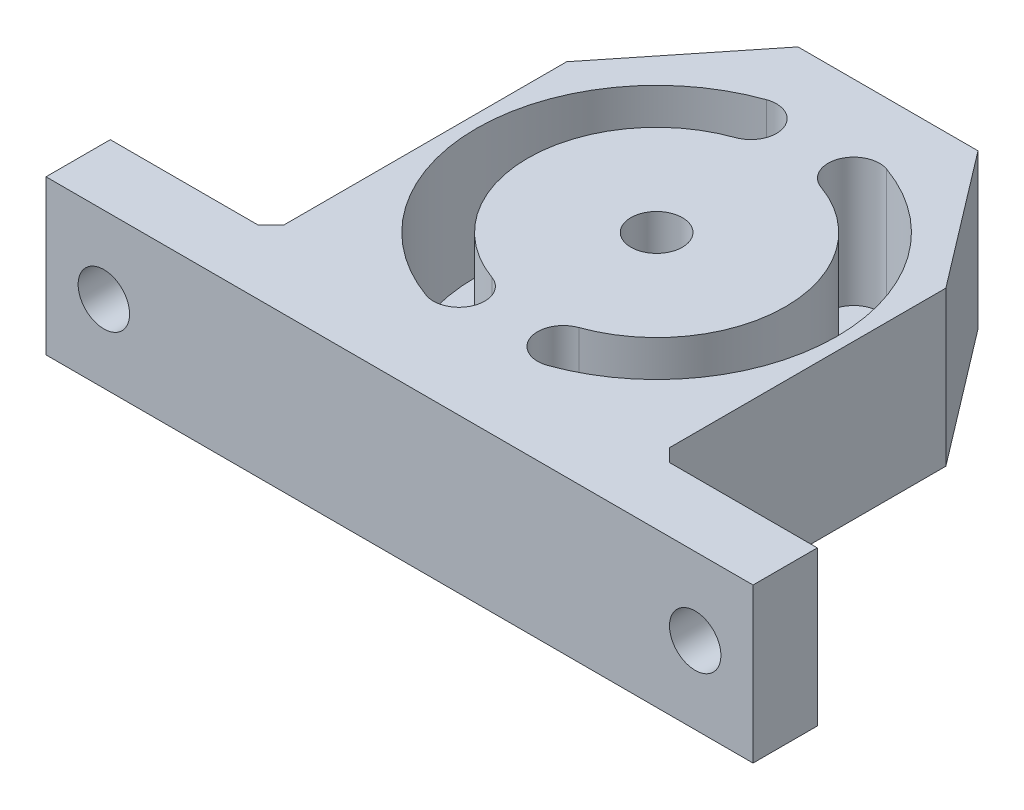
ISO-10303-21;
HEADER;
FILE_DESCRIPTION(('STEP AP214'),'2;1');
FILE_NAME('part.step','',(''),(''),'','','');
FILE_SCHEMA(('AUTOMOTIVE_DESIGN { 1 0 10303 214 1 1 1 1 }'));
ENDSEC;
DATA;
#1=APPLICATION_CONTEXT('core data for automotive mechanical design processes');
#2=APPLICATION_PROTOCOL_DEFINITION('international standard','automotive_design',2000,#1);
#3=PRODUCT_CONTEXT('',#1,'mechanical');
#4=PRODUCT('Part','Part','',(#3));
#5=PRODUCT_RELATED_PRODUCT_CATEGORY('part','',(#4));
#6=PRODUCT_DEFINITION_FORMATION('','',#4);
#7=PRODUCT_DEFINITION_CONTEXT('part definition',#1,'design');
#8=PRODUCT_DEFINITION('design','',#6,#7);
#9=PRODUCT_DEFINITION_SHAPE('','',#8);
#10=(LENGTH_UNIT() NAMED_UNIT(*) SI_UNIT(.MILLI.,.METRE.));
#11=(NAMED_UNIT(*) PLANE_ANGLE_UNIT() SI_UNIT($,.RADIAN.));
#12=(NAMED_UNIT(*) SI_UNIT($,.STERADIAN.) SOLID_ANGLE_UNIT());
#13=UNCERTAINTY_MEASURE_WITH_UNIT(LENGTH_MEASURE(1.E-05),#10,'distance_accuracy_value','');
#14=(GEOMETRIC_REPRESENTATION_CONTEXT(3) GLOBAL_UNCERTAINTY_ASSIGNED_CONTEXT((#13)) GLOBAL_UNIT_ASSIGNED_CONTEXT((#10,
#11,#12)) REPRESENTATION_CONTEXT('',''));
#15=CARTESIAN_POINT('',(0.,0.,0.));
#16=DIRECTION('',(0.,0.,1.));
#17=DIRECTION('',(1.,0.,0.));
#18=AXIS2_PLACEMENT_3D('',#15,#16,#17);
#19=CARTESIAN_POINT('',(0.,12.,0.));
#20=DIRECTION('',(0.,1.,0.));
#21=DIRECTION('',(0.,0.,1.));
#22=AXIS2_PLACEMENT_3D('',#19,#20,#21);
#23=PLANE('',#22);
#24=CARTESIAN_POINT('',(0.,12.,1.49999999999999));
#25=DIRECTION('',(0.,1.,0.));
#26=DIRECTION('',(0.,0.,1.));
#27=AXIS2_PLACEMENT_3D('',#24,#25,#26);
#28=CIRCLE('',#27,2.);
#29=CARTESIAN_POINT('',(0.,12.,3.49999999999999));
#30=VERTEX_POINT('',#29);
#31=EDGE_CURVE('E207',#30,#30,#28,.T.);
#32=ORIENTED_EDGE('',*,*,#31,.F.);
#33=EDGE_LOOP('',(#32));
#34=FACE_BOUND('',#33,.T.);
#35=DIRECTION('',(0.,0.,-1.));
#36=VECTOR('',#35,1.);
#37=CARTESIAN_POINT('',(27.5,12.,16.5));
#38=LINE('',#37,#36);
#39=CARTESIAN_POINT('',(27.5,12.,21.5));
#40=VERTEX_POINT('',#39);
#41=CARTESIAN_POINT('',(27.5,12.,16.5));
#42=VERTEX_POINT('',#41);
#43=EDGE_CURVE('E266',#40,#42,#38,.T.);
#44=ORIENTED_EDGE('',*,*,#43,.T.);
#45=DIRECTION('',(-1.,0.,0.));
#46=VECTOR('',#45,1.);
#47=CARTESIAN_POINT('',(15.,12.,16.5));
#48=LINE('',#47,#46);
#49=CARTESIAN_POINT('',(16.,12.,16.5));
#50=VERTEX_POINT('',#49);
#51=EDGE_CURVE('E269',#42,#50,#48,.T.);
#52=ORIENTED_EDGE('',*,*,#51,.T.);
#53=DIRECTION('',(0.707106781186545,0.,0.70710678118655));
#54=VECTOR('',#53,1.);
#55=CARTESIAN_POINT('',(15.,12.,15.5));
#56=LINE('',#55,#54);
#57=CARTESIAN_POINT('',(15.,12.,15.5));
#58=VERTEX_POINT('',#57);
#59=EDGE_CURVE('E11',#50,#58,#56,.F.);
#60=ORIENTED_EDGE('',*,*,#59,.T.);
#61=DIRECTION('',(0.,0.,-1.));
#62=VECTOR('',#61,1.);
#63=CARTESIAN_POINT('',(15.,12.,16.5));
#64=LINE('',#63,#62);
#65=CARTESIAN_POINT('',(15.,12.,-6.00000000000001));
#66=VERTEX_POINT('',#65);
#67=EDGE_CURVE('E272',#58,#66,#64,.T.);
#68=ORIENTED_EDGE('',*,*,#67,.T.);
#69=DIRECTION('',(-0.606043215262856,0.,-0.795431720032499));
#70=VECTOR('',#69,1.);
#71=CARTESIAN_POINT('',(7.,12.,-16.5));
#72=LINE('',#71,#70);
#73=CARTESIAN_POINT('',(7.,12.,-16.5));
#74=VERTEX_POINT('',#73);
#75=EDGE_CURVE('E274',#66,#74,#72,.T.);
#76=ORIENTED_EDGE('',*,*,#75,.T.);
#77=DIRECTION('',(-1.,0.,0.));
#78=VECTOR('',#77,1.);
#79=CARTESIAN_POINT('',(-7.,12.,-16.5));
#80=LINE('',#79,#78);
#81=CARTESIAN_POINT('',(-7.,12.,-16.5));
#82=VERTEX_POINT('',#81);
#83=EDGE_CURVE('E276',#74,#82,#80,.T.);
#84=ORIENTED_EDGE('',*,*,#83,.T.);
#85=DIRECTION('',(-0.624695047554424,0.,0.78086880944303));
#86=VECTOR('',#85,1.);
#87=CARTESIAN_POINT('',(-15.,12.,-6.50000000000001));
#88=LINE('',#87,#86);
#89=CARTESIAN_POINT('',(-15.,12.,-6.50000000000001));
#90=VERTEX_POINT('',#89);
#91=EDGE_CURVE('E278',#82,#90,#88,.T.);
#92=ORIENTED_EDGE('',*,*,#91,.T.);
#93=DIRECTION('',(0.,0.,1.));
#94=VECTOR('',#93,1.);
#95=CARTESIAN_POINT('',(-15.,12.,16.5));
#96=LINE('',#95,#94);
#97=CARTESIAN_POINT('',(-15.,12.,15.5));
#98=VERTEX_POINT('',#97);
#99=EDGE_CURVE('E280',#90,#98,#96,.T.);
#100=ORIENTED_EDGE('',*,*,#99,.T.);
#101=DIRECTION('',(0.707106781186552,0.,-0.707106781186543));
#102=VECTOR('',#101,1.);
#103=CARTESIAN_POINT('',(-16.,12.,16.5));
#104=LINE('',#103,#102);
#105=CARTESIAN_POINT('',(-16.,12.,16.5));
#106=VERTEX_POINT('',#105);
#107=EDGE_CURVE('E344',#98,#106,#104,.F.);
#108=ORIENTED_EDGE('',*,*,#107,.T.);
#109=DIRECTION('',(-1.,0.,0.));
#110=VECTOR('',#109,1.);
#111=CARTESIAN_POINT('',(-27.5,12.,16.5));
#112=LINE('',#111,#110);
#113=CARTESIAN_POINT('',(-27.5,12.,16.5));
#114=VERTEX_POINT('',#113);
#115=EDGE_CURVE('E283',#106,#114,#112,.T.);
#116=ORIENTED_EDGE('',*,*,#115,.T.);
#117=DIRECTION('',(0.,0.,1.));
#118=VECTOR('',#117,1.);
#119=CARTESIAN_POINT('',(-27.5,12.,16.5));
#120=LINE('',#119,#118);
#121=CARTESIAN_POINT('',(-27.5,12.,21.5));
#122=VERTEX_POINT('',#121);
#123=EDGE_CURVE('E285',#114,#122,#120,.T.);
#124=ORIENTED_EDGE('',*,*,#123,.T.);
#125=DIRECTION('',(1.,0.,0.));
#126=VECTOR('',#125,1.);
#127=CARTESIAN_POINT('',(-27.5,12.,21.5));
#128=LINE('',#127,#126);
#129=EDGE_CURVE('E287',#122,#40,#128,.T.);
#130=ORIENTED_EDGE('',*,*,#129,.T.);
#131=EDGE_LOOP('',(#44,#52,#60,#68,#76,#84,#92,#100,#108,#116,#124,#130));
#132=FACE_BOUND('',#131,.T.);
#133=CARTESIAN_POINT('',(0.,12.,1.49999999999999));
#134=DIRECTION('',(0.,1.,0.));
#135=DIRECTION('',(0.,0.,1.));
#136=AXIS2_PLACEMENT_3D('',#133,#134,#135);
#137=CIRCLE('',#136,14.0184169794819);
#138=CARTESIAN_POINT('',(4.6728056598273,12.,-11.7166902769231));
#139=VERTEX_POINT('',#138);
#140=CARTESIAN_POINT('',(4.72970013097378,12.,14.6964370676972));
#141=VERTEX_POINT('',#140);
#142=EDGE_CURVE('E238',#139,#141,#137,.F.);
#143=ORIENTED_EDGE('',*,*,#142,.T.);
#144=CARTESIAN_POINT('',(4.05491636075259,12.,12.8137084989848));
#145=DIRECTION('',(0.,1.,0.));
#146=DIRECTION('',(0.,0.,1.));
#147=AXIS2_PLACEMENT_3D('',#144,#145,#146);
#148=CIRCLE('',#147,2.);
#149=CARTESIAN_POINT('',(3.3801325905314,12.,10.9309799302723));
#150=VERTEX_POINT('',#149);
#151=EDGE_CURVE('E235',#141,#150,#148,.F.);
#152=ORIENTED_EDGE('',*,*,#151,.T.);
#153=CARTESIAN_POINT('',(0.,12.,1.49999999999999));
#154=DIRECTION('',(0.,1.,0.));
#155=DIRECTION('',(0.,0.,1.));
#156=AXIS2_PLACEMENT_3D('',#153,#154,#155);
#157=CIRCLE('',#156,10.0184169794819);
#158=CARTESIAN_POINT('',(3.33947232649396,12.,-7.94545411059482));
#159=VERTEX_POINT('',#158);
#160=EDGE_CURVE('E227',#159,#150,#157,.F.);
#161=ORIENTED_EDGE('',*,*,#160,.F.);
#162=CARTESIAN_POINT('',(4.00613899316063,12.,-9.83107219375894));
#163=DIRECTION('',(0.,1.,0.));
#164=DIRECTION('',(0.,0.,1.));
#165=AXIS2_PLACEMENT_3D('',#162,#163,#164);
#166=CIRCLE('',#165,2.);
#167=EDGE_CURVE('E242',#159,#139,#166,.F.);
#168=ORIENTED_EDGE('',*,*,#167,.T.);
#169=EDGE_LOOP('',(#143,#152,#161,#168));
#170=FACE_BOUND('',#169,.T.);
#171=CARTESIAN_POINT('',(0.,12.,1.49999999999999));
#172=DIRECTION('',(0.,1.,0.));
#173=DIRECTION('',(0.,0.,1.));
#174=AXIS2_PLACEMENT_3D('',#171,#172,#173);
#175=CIRCLE('',#174,14.0184169794819);
#176=CARTESIAN_POINT('',(-4.6728056598273,12.,-11.7166902769231));
#177=VERTEX_POINT('',#176);
#178=CARTESIAN_POINT('',(-4.72970013097379,12.,14.6964370676972));
#179=VERTEX_POINT('',#178);
#180=EDGE_CURVE('E184',#177,#179,#175,.T.);
#181=ORIENTED_EDGE('',*,*,#180,.F.);
#182=CARTESIAN_POINT('',(-4.00613899316063,12.,-9.83107219375894));
#183=DIRECTION('',(0.,1.,0.));
#184=DIRECTION('',(0.,0.,1.));
#185=AXIS2_PLACEMENT_3D('',#182,#183,#184);
#186=CIRCLE('',#185,2.);
#187=CARTESIAN_POINT('',(-3.33947232649396,12.,-7.94545411059482));
#188=VERTEX_POINT('',#187);
#189=EDGE_CURVE('E201',#188,#177,#186,.T.);
#190=ORIENTED_EDGE('',*,*,#189,.F.);
#191=CARTESIAN_POINT('',(0.,12.,1.49999999999999));
#192=DIRECTION('',(0.,1.,0.));
#193=DIRECTION('',(0.,0.,1.));
#194=AXIS2_PLACEMENT_3D('',#191,#192,#193);
#195=CIRCLE('',#194,10.0184169794819);
#196=CARTESIAN_POINT('',(-3.3801325905314,12.,10.9309799302723));
#197=VERTEX_POINT('',#196);
#198=EDGE_CURVE('E204',#188,#197,#195,.T.);
#199=ORIENTED_EDGE('',*,*,#198,.T.);
#200=CARTESIAN_POINT('',(-4.05491636075259,12.,12.8137084989848));
#201=DIRECTION('',(0.,1.,0.));
#202=DIRECTION('',(0.,0.,1.));
#203=AXIS2_PLACEMENT_3D('',#200,#201,#202);
#204=CIRCLE('',#203,2.);
#205=EDGE_CURVE('E213',#179,#197,#204,.T.);
#206=ORIENTED_EDGE('',*,*,#205,.F.);
#207=EDGE_LOOP('',(#181,#190,#199,#206));
#208=FACE_BOUND('',#207,.T.);
#209=ADVANCED_FACE('F41',(#34,#132,#170,#208),#23,.T.);
#210=CARTESIAN_POINT('',(27.5,12.,16.5));
#211=DIRECTION('',(-1.,0.,0.));
#212=DIRECTION('',(0.,0.,1.));
#213=AXIS2_PLACEMENT_3D('',#210,#211,#212);
#214=PLANE('',#213);
#215=DIRECTION('',(0.,0.,-1.));
#216=VECTOR('',#215,1.);
#217=CARTESIAN_POINT('',(27.5,0.,16.5));
#218=LINE('',#217,#216);
#219=CARTESIAN_POINT('',(27.5,0.,21.5));
#220=VERTEX_POINT('',#219);
#221=CARTESIAN_POINT('',(27.5,0.,16.5));
#222=VERTEX_POINT('',#221);
#223=EDGE_CURVE('E265',#220,#222,#218,.T.);
#224=ORIENTED_EDGE('',*,*,#223,.T.);
#225=DIRECTION('',(0.,-1.,0.));
#226=VECTOR('',#225,1.);
#227=CARTESIAN_POINT('',(27.5,12.,16.5));
#228=LINE('',#227,#226);
#229=EDGE_CURVE('E330',#42,#222,#228,.T.);
#230=ORIENTED_EDGE('',*,*,#229,.F.);
#231=ORIENTED_EDGE('',*,*,#43,.F.);
#232=DIRECTION('',(0.,-1.,0.));
#233=VECTOR('',#232,1.);
#234=CARTESIAN_POINT('',(27.5,12.,21.5));
#235=LINE('',#234,#233);
#236=EDGE_CURVE('E289',#40,#220,#235,.T.);
#237=ORIENTED_EDGE('',*,*,#236,.T.);
#238=EDGE_LOOP('',(#224,#230,#231,#237));
#239=FACE_BOUND('',#238,.T.);
#240=ADVANCED_FACE('F391',(#239),#214,.F.);
#241=CARTESIAN_POINT('',(15.,12.,16.5));
#242=DIRECTION('',(0.,0.,1.));
#243=DIRECTION('',(1.,0.,0.));
#244=AXIS2_PLACEMENT_3D('',#241,#242,#243);
#245=PLANE('',#244);
#246=CARTESIAN_POINT('',(23.,6.,16.5));
#247=DIRECTION('',(0.,0.,1.));
#248=DIRECTION('',(1.,0.,0.));
#249=AXIS2_PLACEMENT_3D('',#246,#247,#248);
#250=CIRCLE('',#249,2.);
#251=CARTESIAN_POINT('',(25.,6.,16.5));
#252=VERTEX_POINT('',#251);
#253=EDGE_CURVE('E257',#252,#252,#250,.T.);
#254=ORIENTED_EDGE('',*,*,#253,.T.);
#255=EDGE_LOOP('',(#254));
#256=FACE_BOUND('',#255,.T.);
#257=DIRECTION('',(-1.,0.,0.));
#258=VECTOR('',#257,1.);
#259=CARTESIAN_POINT('',(15.,0.,16.5));
#260=LINE('',#259,#258);
#261=CARTESIAN_POINT('',(16.,0.,16.5));
#262=VERTEX_POINT('',#261);
#263=EDGE_CURVE('E292',#222,#262,#260,.T.);
#264=ORIENTED_EDGE('',*,*,#263,.T.);
#265=DIRECTION('',(0.,1.,0.));
#266=VECTOR('',#265,1.);
#267=CARTESIAN_POINT('',(16.,12.,16.5));
#268=LINE('',#267,#266);
#269=EDGE_CURVE('E57',#262,#50,#268,.T.);
#270=ORIENTED_EDGE('',*,*,#269,.T.);
#271=ORIENTED_EDGE('',*,*,#51,.F.);
#272=ORIENTED_EDGE('',*,*,#229,.T.);
#273=EDGE_LOOP('',(#264,#270,#271,#272));
#274=FACE_BOUND('',#273,.T.);
#275=ADVANCED_FACE('F389',(#256,#274),#245,.F.);
#276=CARTESIAN_POINT('',(15.,12.,16.5));
#277=DIRECTION('',(-1.,0.,0.));
#278=DIRECTION('',(0.,0.,1.));
#279=AXIS2_PLACEMENT_3D('',#276,#277,#278);
#280=PLANE('',#279);
#281=ORIENTED_EDGE('',*,*,#67,.F.);
#282=DIRECTION('',(0.,-1.,0.));
#283=VECTOR('',#282,1.);
#284=CARTESIAN_POINT('',(15.,0.,15.5));
#285=LINE('',#284,#283);
#286=CARTESIAN_POINT('',(15.,0.,15.5));
#287=VERTEX_POINT('',#286);
#288=EDGE_CURVE('E338',#58,#287,#285,.T.);
#289=ORIENTED_EDGE('',*,*,#288,.T.);
#290=DIRECTION('',(0.,0.,-1.));
#291=VECTOR('',#290,1.);
#292=CARTESIAN_POINT('',(15.,0.,16.5));
#293=LINE('',#292,#291);
#294=CARTESIAN_POINT('',(15.,0.,-6.00000000000001));
#295=VERTEX_POINT('',#294);
#296=EDGE_CURVE('E294',#287,#295,#293,.T.);
#297=ORIENTED_EDGE('',*,*,#296,.T.);
#298=DIRECTION('',(0.,-1.,0.));
#299=VECTOR('',#298,1.);
#300=CARTESIAN_POINT('',(15.,12.,-6.00000000000001));
#301=LINE('',#300,#299);
#302=EDGE_CURVE('E327',#66,#295,#301,.T.);
#303=ORIENTED_EDGE('',*,*,#302,.F.);
#304=EDGE_LOOP('',(#281,#289,#297,#303));
#305=FACE_BOUND('',#304,.T.);
#306=ADVANCED_FACE('F383',(#305),#280,.F.);
#307=CARTESIAN_POINT('',(7.,12.,-16.5));
#308=DIRECTION('',(-0.795431720032499,0.,0.606043215262856));
#309=DIRECTION('',(0.606043215262856,0.,0.795431720032499));
#310=AXIS2_PLACEMENT_3D('',#307,#308,#309);
#311=PLANE('',#310);
#312=DIRECTION('',(-0.606043215262856,0.,-0.795431720032499));
#313=VECTOR('',#312,1.);
#314=CARTESIAN_POINT('',(7.,0.,-16.5));
#315=LINE('',#314,#313);
#316=CARTESIAN_POINT('',(7.,0.,-16.5));
#317=VERTEX_POINT('',#316);
#318=EDGE_CURVE('E296',#295,#317,#315,.T.);
#319=ORIENTED_EDGE('',*,*,#318,.T.);
#320=DIRECTION('',(0.,-1.,0.));
#321=VECTOR('',#320,1.);
#322=CARTESIAN_POINT('',(7.,12.,-16.5));
#323=LINE('',#322,#321);
#324=EDGE_CURVE('E324',#74,#317,#323,.T.);
#325=ORIENTED_EDGE('',*,*,#324,.F.);
#326=ORIENTED_EDGE('',*,*,#75,.F.);
#327=ORIENTED_EDGE('',*,*,#302,.T.);
#328=EDGE_LOOP('',(#319,#325,#326,#327));
#329=FACE_BOUND('',#328,.T.);
#330=ADVANCED_FACE('F379',(#329),#311,.F.);
#331=CARTESIAN_POINT('',(-7.,12.,-16.5));
#332=DIRECTION('',(0.,0.,1.));
#333=DIRECTION('',(1.,0.,0.));
#334=AXIS2_PLACEMENT_3D('',#331,#332,#333);
#335=PLANE('',#334);
#336=DIRECTION('',(-1.,0.,0.));
#337=VECTOR('',#336,1.);
#338=CARTESIAN_POINT('',(-7.,0.,-16.5));
#339=LINE('',#338,#337);
#340=CARTESIAN_POINT('',(-7.,0.,-16.5));
#341=VERTEX_POINT('',#340);
#342=EDGE_CURVE('E298',#317,#341,#339,.T.);
#343=ORIENTED_EDGE('',*,*,#342,.T.);
#344=DIRECTION('',(0.,-1.,0.));
#345=VECTOR('',#344,1.);
#346=CARTESIAN_POINT('',(-7.,12.,-16.5));
#347=LINE('',#346,#345);
#348=EDGE_CURVE('E321',#82,#341,#347,.T.);
#349=ORIENTED_EDGE('',*,*,#348,.F.);
#350=ORIENTED_EDGE('',*,*,#83,.F.);
#351=ORIENTED_EDGE('',*,*,#324,.T.);
#352=EDGE_LOOP('',(#343,#349,#350,#351));
#353=FACE_BOUND('',#352,.T.);
#354=ADVANCED_FACE('F374',(#353),#335,.F.);
#355=CARTESIAN_POINT('',(-15.,12.,-6.50000000000001));
#356=DIRECTION('',(0.78086880944303,0.,0.624695047554424));
#357=DIRECTION('',(0.624695047554424,0.,-0.78086880944303));
#358=AXIS2_PLACEMENT_3D('',#355,#356,#357);
#359=PLANE('',#358);
#360=DIRECTION('',(-0.624695047554424,0.,0.78086880944303));
#361=VECTOR('',#360,1.);
#362=CARTESIAN_POINT('',(-15.,0.,-6.50000000000001));
#363=LINE('',#362,#361);
#364=CARTESIAN_POINT('',(-15.,0.,-6.50000000000001));
#365=VERTEX_POINT('',#364);
#366=EDGE_CURVE('E300',#341,#365,#363,.T.);
#367=ORIENTED_EDGE('',*,*,#366,.T.);
#368=DIRECTION('',(0.,-1.,0.));
#369=VECTOR('',#368,1.);
#370=CARTESIAN_POINT('',(-15.,12.,-6.50000000000001));
#371=LINE('',#370,#369);
#372=EDGE_CURVE('E318',#90,#365,#371,.T.);
#373=ORIENTED_EDGE('',*,*,#372,.F.);
#374=ORIENTED_EDGE('',*,*,#91,.F.);
#375=ORIENTED_EDGE('',*,*,#348,.T.);
#376=EDGE_LOOP('',(#367,#373,#374,#375));
#377=FACE_BOUND('',#376,.T.);
#378=ADVANCED_FACE('F369',(#377),#359,.F.);
#379=CARTESIAN_POINT('',(-15.,12.,16.5));
#380=DIRECTION('',(1.,0.,0.));
#381=DIRECTION('',(0.,0.,-1.));
#382=AXIS2_PLACEMENT_3D('',#379,#380,#381);
#383=PLANE('',#382);
#384=DIRECTION('',(0.,0.,1.));
#385=VECTOR('',#384,1.);
#386=CARTESIAN_POINT('',(-15.,0.,16.5));
#387=LINE('',#386,#385);
#388=CARTESIAN_POINT('',(-15.,0.,15.5));
#389=VERTEX_POINT('',#388);
#390=EDGE_CURVE('E302',#365,#389,#387,.T.);
#391=ORIENTED_EDGE('',*,*,#390,.T.);
#392=DIRECTION('',(0.,1.,0.));
#393=VECTOR('',#392,1.);
#394=CARTESIAN_POINT('',(-15.,12.,15.5));
#395=LINE('',#394,#393);
#396=EDGE_CURVE('E336',#389,#98,#395,.T.);
#397=ORIENTED_EDGE('',*,*,#396,.T.);
#398=ORIENTED_EDGE('',*,*,#99,.F.);
#399=ORIENTED_EDGE('',*,*,#372,.T.);
#400=EDGE_LOOP('',(#391,#397,#398,#399));
#401=FACE_BOUND('',#400,.T.);
#402=ADVANCED_FACE('F365',(#401),#383,.F.);
#403=CARTESIAN_POINT('',(-27.5,12.,16.5));
#404=DIRECTION('',(0.,0.,1.));
#405=DIRECTION('',(1.,0.,0.));
#406=AXIS2_PLACEMENT_3D('',#403,#404,#405);
#407=PLANE('',#406);
#408=CARTESIAN_POINT('',(-23.,6.,16.5));
#409=DIRECTION('',(0.,0.,1.));
#410=DIRECTION('',(1.,0.,0.));
#411=AXIS2_PLACEMENT_3D('',#408,#409,#410);
#412=CIRCLE('',#411,2.);
#413=CARTESIAN_POINT('',(-21.,6.,16.5));
#414=VERTEX_POINT('',#413);
#415=EDGE_CURVE('E262',#414,#414,#412,.T.);
#416=ORIENTED_EDGE('',*,*,#415,.T.);
#417=EDGE_LOOP('',(#416));
#418=FACE_BOUND('',#417,.T.);
#419=ORIENTED_EDGE('',*,*,#115,.F.);
#420=DIRECTION('',(0.,-1.,0.));
#421=VECTOR('',#420,1.);
#422=CARTESIAN_POINT('',(-16.,0.,16.5));
#423=LINE('',#422,#421);
#424=CARTESIAN_POINT('',(-16.,0.,16.5));
#425=VERTEX_POINT('',#424);
#426=EDGE_CURVE('E333',#106,#425,#423,.T.);
#427=ORIENTED_EDGE('',*,*,#426,.T.);
#428=DIRECTION('',(-1.,0.,0.));
#429=VECTOR('',#428,1.);
#430=CARTESIAN_POINT('',(-27.5,0.,16.5));
#431=LINE('',#430,#429);
#432=CARTESIAN_POINT('',(-27.5,0.,16.5));
#433=VERTEX_POINT('',#432);
#434=EDGE_CURVE('E305',#425,#433,#431,.T.);
#435=ORIENTED_EDGE('',*,*,#434,.T.);
#436=DIRECTION('',(0.,-1.,0.));
#437=VECTOR('',#436,1.);
#438=CARTESIAN_POINT('',(-27.5,12.,16.5));
#439=LINE('',#438,#437);
#440=EDGE_CURVE('E315',#114,#433,#439,.T.);
#441=ORIENTED_EDGE('',*,*,#440,.F.);
#442=EDGE_LOOP('',(#419,#427,#435,#441));
#443=FACE_BOUND('',#442,.T.);
#444=ADVANCED_FACE('F355',(#418,#443),#407,.F.);
#445=CARTESIAN_POINT('',(-27.5,12.,16.5));
#446=DIRECTION('',(1.,0.,0.));
#447=DIRECTION('',(0.,0.,-1.));
#448=AXIS2_PLACEMENT_3D('',#445,#446,#447);
#449=PLANE('',#448);
#450=DIRECTION('',(0.,0.,1.));
#451=VECTOR('',#450,1.);
#452=CARTESIAN_POINT('',(-27.5,0.,16.5));
#453=LINE('',#452,#451);
#454=CARTESIAN_POINT('',(-27.5,0.,21.5));
#455=VERTEX_POINT('',#454);
#456=EDGE_CURVE('E307',#433,#455,#453,.T.);
#457=ORIENTED_EDGE('',*,*,#456,.T.);
#458=DIRECTION('',(0.,-1.,0.));
#459=VECTOR('',#458,1.);
#460=CARTESIAN_POINT('',(-27.5,12.,21.5));
#461=LINE('',#460,#459);
#462=EDGE_CURVE('E312',#122,#455,#461,.T.);
#463=ORIENTED_EDGE('',*,*,#462,.F.);
#464=ORIENTED_EDGE('',*,*,#123,.F.);
#465=ORIENTED_EDGE('',*,*,#440,.T.);
#466=EDGE_LOOP('',(#457,#463,#464,#465));
#467=FACE_BOUND('',#466,.T.);
#468=ADVANCED_FACE('F399',(#467),#449,.F.);
#469=CARTESIAN_POINT('',(-27.5,12.,21.5));
#470=DIRECTION('',(0.,0.,-1.));
#471=DIRECTION('',(-1.,0.,0.));
#472=AXIS2_PLACEMENT_3D('',#469,#470,#471);
#473=PLANE('',#472);
#474=CARTESIAN_POINT('',(-23.,6.,21.5));
#475=DIRECTION('',(0.,0.,1.));
#476=DIRECTION('',(1.,0.,0.));
#477=AXIS2_PLACEMENT_3D('',#474,#475,#476);
#478=CIRCLE('',#477,2.);
#479=CARTESIAN_POINT('',(-21.,6.,21.5));
#480=VERTEX_POINT('',#479);
#481=EDGE_CURVE('E254',#480,#480,#478,.T.);
#482=ORIENTED_EDGE('',*,*,#481,.F.);
#483=EDGE_LOOP('',(#482));
#484=FACE_BOUND('',#483,.T.);
#485=CARTESIAN_POINT('',(23.,6.,21.5));
#486=DIRECTION('',(0.,0.,1.));
#487=DIRECTION('',(1.,0.,0.));
#488=AXIS2_PLACEMENT_3D('',#485,#486,#487);
#489=CIRCLE('',#488,2.);
#490=CARTESIAN_POINT('',(25.,6.,21.5));
#491=VERTEX_POINT('',#490);
#492=EDGE_CURVE('E220',#491,#491,#489,.T.);
#493=ORIENTED_EDGE('',*,*,#492,.F.);
#494=EDGE_LOOP('',(#493));
#495=FACE_BOUND('',#494,.T.);
#496=DIRECTION('',(1.,0.,0.));
#497=VECTOR('',#496,1.);
#498=CARTESIAN_POINT('',(-27.5,0.,21.5));
#499=LINE('',#498,#497);
#500=EDGE_CURVE('E270',#455,#220,#499,.T.);
#501=ORIENTED_EDGE('',*,*,#500,.T.);
#502=ORIENTED_EDGE('',*,*,#236,.F.);
#503=ORIENTED_EDGE('',*,*,#129,.F.);
#504=ORIENTED_EDGE('',*,*,#462,.T.);
#505=EDGE_LOOP('',(#501,#502,#503,#504));
#506=FACE_BOUND('',#505,.T.);
#507=ADVANCED_FACE('F395',(#484,#495,#506),#473,.F.);
#508=CARTESIAN_POINT('',(0.,0.,0.));
#509=DIRECTION('',(0.,1.,0.));
#510=DIRECTION('',(0.,0.,1.));
#511=AXIS2_PLACEMENT_3D('',#508,#509,#510);
#512=PLANE('',#511);
#513=CARTESIAN_POINT('',(0.,0.,1.49999999999999));
#514=DIRECTION('',(0.,1.,0.));
#515=DIRECTION('',(0.,0.,1.));
#516=AXIS2_PLACEMENT_3D('',#513,#514,#515);
#517=CIRCLE('',#516,2.);
#518=CARTESIAN_POINT('',(0.,0.,3.49999999999999));
#519=VERTEX_POINT('',#518);
#520=EDGE_CURVE('E239',#519,#519,#517,.T.);
#521=ORIENTED_EDGE('',*,*,#520,.T.);
#522=EDGE_LOOP('',(#521));
#523=FACE_BOUND('',#522,.T.);
#524=ORIENTED_EDGE('',*,*,#223,.F.);
#525=ORIENTED_EDGE('',*,*,#500,.F.);
#526=ORIENTED_EDGE('',*,*,#456,.F.);
#527=ORIENTED_EDGE('',*,*,#434,.F.);
#528=DIRECTION('',(-0.707106781186552,0.,0.707106781186543));
#529=VECTOR('',#528,1.);
#530=CARTESIAN_POINT('',(0.250000000000083,0.,0.250000000000086));
#531=LINE('',#530,#529);
#532=EDGE_CURVE('E342',#425,#389,#531,.F.);
#533=ORIENTED_EDGE('',*,*,#532,.T.);
#534=ORIENTED_EDGE('',*,*,#390,.F.);
#535=ORIENTED_EDGE('',*,*,#366,.F.);
#536=ORIENTED_EDGE('',*,*,#342,.F.);
#537=ORIENTED_EDGE('',*,*,#318,.F.);
#538=ORIENTED_EDGE('',*,*,#296,.F.);
#539=DIRECTION('',(-0.707106781186545,0.,-0.70710678118655));
#540=VECTOR('',#539,1.);
#541=CARTESIAN_POINT('',(-0.249999999999935,0.,0.249999999999933));
#542=LINE('',#541,#540);
#543=EDGE_CURVE('E50',#287,#262,#542,.F.);
#544=ORIENTED_EDGE('',*,*,#543,.T.);
#545=ORIENTED_EDGE('',*,*,#263,.F.);
#546=EDGE_LOOP('',(#524,#525,#526,#527,#533,#534,#535,#536,#537,#538,#544,#545));
#547=FACE_BOUND('',#546,.T.);
#548=ADVANCED_FACE('F361',(#523,#547),#512,.F.);
#549=CARTESIAN_POINT('',(23.,6.,-16.5));
#550=DIRECTION('',(0.,0.,1.));
#551=DIRECTION('',(1.,0.,0.));
#552=AXIS2_PLACEMENT_3D('',#549,#550,#551);
#553=CYLINDRICAL_SURFACE('',#552,2.);
#554=ORIENTED_EDGE('',*,*,#492,.T.);
#555=EDGE_LOOP('',(#554));
#556=FACE_BOUND('',#555,.T.);
#557=ORIENTED_EDGE('',*,*,#253,.F.);
#558=EDGE_LOOP('',(#557));
#559=FACE_BOUND('',#558,.T.);
#560=ADVANCED_FACE('F420',(#556,#559),#553,.F.);
#561=CARTESIAN_POINT('',(-23.,6.,-16.5));
#562=DIRECTION('',(0.,0.,1.));
#563=DIRECTION('',(1.,0.,0.));
#564=AXIS2_PLACEMENT_3D('',#561,#562,#563);
#565=CYLINDRICAL_SURFACE('',#564,2.);
#566=ORIENTED_EDGE('',*,*,#481,.T.);
#567=EDGE_LOOP('',(#566));
#568=FACE_BOUND('',#567,.T.);
#569=ORIENTED_EDGE('',*,*,#415,.F.);
#570=EDGE_LOOP('',(#569));
#571=FACE_BOUND('',#570,.T.);
#572=ADVANCED_FACE('F427',(#568,#571),#565,.F.);
#573=CARTESIAN_POINT('',(4.05491636075259,2.,12.8137084989848));
#574=DIRECTION('',(0.,1.,0.));
#575=DIRECTION('',(0.,0.,1.));
#576=AXIS2_PLACEMENT_3D('',#573,#574,#575);
#577=CYLINDRICAL_SURFACE('',#576,2.);
#578=ORIENTED_EDGE('',*,*,#151,.F.);
#579=DIRECTION('',(0.,1.,0.));
#580=VECTOR('',#579,1.);
#581=CARTESIAN_POINT('',(4.72970013097378,2.,14.6964370676972));
#582=LINE('',#581,#580);
#583=CARTESIAN_POINT('',(4.72970013097378,2.,14.6964370676972));
#584=VERTEX_POINT('',#583);
#585=EDGE_CURVE('E234',#584,#141,#582,.T.);
#586=ORIENTED_EDGE('',*,*,#585,.F.);
#587=CARTESIAN_POINT('',(4.05491636075259,2.,12.8137084989848));
#588=DIRECTION('',(0.,1.,0.));
#589=DIRECTION('',(0.,0.,1.));
#590=AXIS2_PLACEMENT_3D('',#587,#588,#589);
#591=CIRCLE('',#590,2.);
#592=CARTESIAN_POINT('',(3.3801325905314,2.,10.9309799302723));
#593=VERTEX_POINT('',#592);
#594=EDGE_CURVE('E224',#584,#593,#591,.F.);
#595=ORIENTED_EDGE('',*,*,#594,.T.);
#596=DIRECTION('',(0.,1.,0.));
#597=VECTOR('',#596,1.);
#598=CARTESIAN_POINT('',(3.3801325905314,2.,10.9309799302723));
#599=LINE('',#598,#597);
#600=EDGE_CURVE('E214',#593,#150,#599,.T.);
#601=ORIENTED_EDGE('',*,*,#600,.T.);
#602=EDGE_LOOP('',(#578,#586,#595,#601));
#603=FACE_BOUND('',#602,.T.);
#604=ADVANCED_FACE('F464',(#603),#577,.F.);
#605=CARTESIAN_POINT('',(0.,2.,1.49999999999999));
#606=DIRECTION('',(0.,1.,0.));
#607=DIRECTION('',(0.,0.,1.));
#608=AXIS2_PLACEMENT_3D('',#605,#606,#607);
#609=CYLINDRICAL_SURFACE('',#608,10.0184169794819);
#610=ORIENTED_EDGE('',*,*,#160,.T.);
#611=ORIENTED_EDGE('',*,*,#600,.F.);
#612=CARTESIAN_POINT('',(0.,2.,1.49999999999999));
#613=DIRECTION('',(0.,1.,0.));
#614=DIRECTION('',(0.,0.,1.));
#615=AXIS2_PLACEMENT_3D('',#612,#613,#614);
#616=CIRCLE('',#615,10.0184169794819);
#617=CARTESIAN_POINT('',(3.33947232649396,2.,-7.94545411059482));
#618=VERTEX_POINT('',#617);
#619=EDGE_CURVE('E231',#618,#593,#616,.F.);
#620=ORIENTED_EDGE('',*,*,#619,.F.);
#621=DIRECTION('',(0.,1.,0.));
#622=VECTOR('',#621,1.);
#623=CARTESIAN_POINT('',(3.33947232649396,2.,-7.94545411059482));
#624=LINE('',#623,#622);
#625=EDGE_CURVE('E248',#618,#159,#624,.T.);
#626=ORIENTED_EDGE('',*,*,#625,.T.);
#627=EDGE_LOOP('',(#610,#611,#620,#626));
#628=FACE_BOUND('',#627,.T.);
#629=ADVANCED_FACE('F460',(#628),#609,.T.);
#630=CARTESIAN_POINT('',(4.00613899316063,2.,-9.83107219375894));
#631=DIRECTION('',(0.,1.,0.));
#632=DIRECTION('',(0.,0.,1.));
#633=AXIS2_PLACEMENT_3D('',#630,#631,#632);
#634=CYLINDRICAL_SURFACE('',#633,2.);
#635=ORIENTED_EDGE('',*,*,#167,.F.);
#636=ORIENTED_EDGE('',*,*,#625,.F.);
#637=CARTESIAN_POINT('',(4.00613899316063,2.,-9.83107219375894));
#638=DIRECTION('',(0.,1.,0.));
#639=DIRECTION('',(0.,0.,1.));
#640=AXIS2_PLACEMENT_3D('',#637,#638,#639);
#641=CIRCLE('',#640,2.);
#642=CARTESIAN_POINT('',(4.6728056598273,2.,-11.7166902769231));
#643=VERTEX_POINT('',#642);
#644=EDGE_CURVE('E229',#618,#643,#641,.F.);
#645=ORIENTED_EDGE('',*,*,#644,.T.);
#646=DIRECTION('',(0.,1.,0.));
#647=VECTOR('',#646,1.);
#648=CARTESIAN_POINT('',(4.6728056598273,2.,-11.7166902769231));
#649=LINE('',#648,#647);
#650=EDGE_CURVE('E250',#643,#139,#649,.T.);
#651=ORIENTED_EDGE('',*,*,#650,.T.);
#652=EDGE_LOOP('',(#635,#636,#645,#651));
#653=FACE_BOUND('',#652,.T.);
#654=ADVANCED_FACE('F463',(#653),#634,.F.);
#655=CARTESIAN_POINT('',(0.,2.,1.49999999999999));
#656=DIRECTION('',(0.,1.,0.));
#657=DIRECTION('',(0.,0.,1.));
#658=AXIS2_PLACEMENT_3D('',#655,#656,#657);
#659=CYLINDRICAL_SURFACE('',#658,14.0184169794819);
#660=ORIENTED_EDGE('',*,*,#142,.F.);
#661=ORIENTED_EDGE('',*,*,#650,.F.);
#662=CARTESIAN_POINT('',(0.,2.,1.49999999999999));
#663=DIRECTION('',(0.,1.,0.));
#664=DIRECTION('',(0.,0.,1.));
#665=AXIS2_PLACEMENT_3D('',#662,#663,#664);
#666=CIRCLE('',#665,14.0184169794819);
#667=EDGE_CURVE('E226',#643,#584,#666,.F.);
#668=ORIENTED_EDGE('',*,*,#667,.T.);
#669=ORIENTED_EDGE('',*,*,#585,.T.);
#670=EDGE_LOOP('',(#660,#661,#668,#669));
#671=FACE_BOUND('',#670,.T.);
#672=ADVANCED_FACE('F458',(#671),#659,.F.);
#673=CARTESIAN_POINT('',(0.,2.,0.));
#674=DIRECTION('',(0.,1.,0.));
#675=DIRECTION('',(0.,0.,1.));
#676=AXIS2_PLACEMENT_3D('',#673,#674,#675);
#677=PLANE('',#676);
#678=ORIENTED_EDGE('',*,*,#594,.F.);
#679=ORIENTED_EDGE('',*,*,#667,.F.);
#680=ORIENTED_EDGE('',*,*,#644,.F.);
#681=ORIENTED_EDGE('',*,*,#619,.T.);
#682=EDGE_LOOP('',(#678,#679,#680,#681));
#683=FACE_BOUND('',#682,.T.);
#684=ADVANCED_FACE('F455',(#683),#677,.T.);
#685=CARTESIAN_POINT('',(0.,2.,1.49999999999999));
#686=DIRECTION('',(0.,1.,0.));
#687=DIRECTION('',(0.,0.,1.));
#688=AXIS2_PLACEMENT_3D('',#685,#686,#687);
#689=CYLINDRICAL_SURFACE('',#688,14.0184169794819);
#690=ORIENTED_EDGE('',*,*,#180,.T.);
#691=DIRECTION('',(0.,1.,0.));
#692=VECTOR('',#691,1.);
#693=CARTESIAN_POINT('',(-4.72970013097379,2.,14.6964370676972));
#694=LINE('',#693,#692);
#695=CARTESIAN_POINT('',(-4.72970013097379,2.,14.6964370676972));
#696=VERTEX_POINT('',#695);
#697=EDGE_CURVE('E177',#696,#179,#694,.T.);
#698=ORIENTED_EDGE('',*,*,#697,.F.);
#699=CARTESIAN_POINT('',(0.,2.,1.49999999999999));
#700=DIRECTION('',(0.,1.,0.));
#701=DIRECTION('',(0.,0.,1.));
#702=AXIS2_PLACEMENT_3D('',#699,#700,#701);
#703=CIRCLE('',#702,14.0184169794819);
#704=CARTESIAN_POINT('',(-4.6728056598273,2.,-11.7166902769231));
#705=VERTEX_POINT('',#704);
#706=EDGE_CURVE('E181',#705,#696,#703,.T.);
#707=ORIENTED_EDGE('',*,*,#706,.F.);
#708=DIRECTION('',(0.,1.,0.));
#709=VECTOR('',#708,1.);
#710=CARTESIAN_POINT('',(-4.6728056598273,2.,-11.7166902769231));
#711=LINE('',#710,#709);
#712=EDGE_CURVE('E218',#705,#177,#711,.T.);
#713=ORIENTED_EDGE('',*,*,#712,.T.);
#714=EDGE_LOOP('',(#690,#698,#707,#713));
#715=FACE_BOUND('',#714,.T.);
#716=ADVANCED_FACE('F179',(#715),#689,.F.);
#717=CARTESIAN_POINT('',(-4.00613899316063,2.,-9.83107219375894));
#718=DIRECTION('',(0.,1.,0.));
#719=DIRECTION('',(0.,0.,1.));
#720=AXIS2_PLACEMENT_3D('',#717,#718,#719);
#721=CYLINDRICAL_SURFACE('',#720,2.);
#722=ORIENTED_EDGE('',*,*,#189,.T.);
#723=ORIENTED_EDGE('',*,*,#712,.F.);
#724=CARTESIAN_POINT('',(-4.00613899316063,2.,-9.83107219375894));
#725=DIRECTION('',(0.,1.,0.));
#726=DIRECTION('',(0.,0.,1.));
#727=AXIS2_PLACEMENT_3D('',#724,#725,#726);
#728=CIRCLE('',#727,2.);
#729=CARTESIAN_POINT('',(-3.33947232649396,2.,-7.94545411059482));
#730=VERTEX_POINT('',#729);
#731=EDGE_CURVE('E189',#730,#705,#728,.T.);
#732=ORIENTED_EDGE('',*,*,#731,.F.);
#733=DIRECTION('',(0.,1.,0.));
#734=VECTOR('',#733,1.);
#735=CARTESIAN_POINT('',(-3.33947232649396,2.,-7.94545411059482));
#736=LINE('',#735,#734);
#737=EDGE_CURVE('E221',#730,#188,#736,.T.);
#738=ORIENTED_EDGE('',*,*,#737,.T.);
#739=EDGE_LOOP('',(#722,#723,#732,#738));
#740=FACE_BOUND('',#739,.T.);
#741=ADVANCED_FACE('F443',(#740),#721,.F.);
#742=CARTESIAN_POINT('',(0.,2.,1.49999999999999));
#743=DIRECTION('',(0.,1.,0.));
#744=DIRECTION('',(0.,0.,1.));
#745=AXIS2_PLACEMENT_3D('',#742,#743,#744);
#746=CYLINDRICAL_SURFACE('',#745,10.0184169794819);
#747=ORIENTED_EDGE('',*,*,#198,.F.);
#748=ORIENTED_EDGE('',*,*,#737,.F.);
#749=CARTESIAN_POINT('',(0.,2.,1.49999999999999));
#750=DIRECTION('',(0.,1.,0.));
#751=DIRECTION('',(0.,0.,1.));
#752=AXIS2_PLACEMENT_3D('',#749,#750,#751);
#753=CIRCLE('',#752,10.0184169794819);
#754=CARTESIAN_POINT('',(-3.3801325905314,2.,10.9309799302723));
#755=VERTEX_POINT('',#754);
#756=EDGE_CURVE('E197',#730,#755,#753,.T.);
#757=ORIENTED_EDGE('',*,*,#756,.T.);
#758=DIRECTION('',(0.,1.,0.));
#759=VECTOR('',#758,1.);
#760=CARTESIAN_POINT('',(-3.3801325905314,2.,10.9309799302723));
#761=LINE('',#760,#759);
#762=EDGE_CURVE('E188',#755,#197,#761,.T.);
#763=ORIENTED_EDGE('',*,*,#762,.T.);
#764=EDGE_LOOP('',(#747,#748,#757,#763));
#765=FACE_BOUND('',#764,.T.);
#766=ADVANCED_FACE('F446',(#765),#746,.T.);
#767=CARTESIAN_POINT('',(-4.05491636075259,2.,12.8137084989848));
#768=DIRECTION('',(0.,1.,0.));
#769=DIRECTION('',(0.,0.,1.));
#770=AXIS2_PLACEMENT_3D('',#767,#768,#769);
#771=CYLINDRICAL_SURFACE('',#770,2.);
#772=ORIENTED_EDGE('',*,*,#205,.T.);
#773=ORIENTED_EDGE('',*,*,#762,.F.);
#774=CARTESIAN_POINT('',(-4.05491636075259,2.,12.8137084989848));
#775=DIRECTION('',(0.,1.,0.));
#776=DIRECTION('',(0.,0.,1.));
#777=AXIS2_PLACEMENT_3D('',#774,#775,#776);
#778=CIRCLE('',#777,2.);
#779=EDGE_CURVE('E193',#696,#755,#778,.T.);
#780=ORIENTED_EDGE('',*,*,#779,.F.);
#781=ORIENTED_EDGE('',*,*,#697,.T.);
#782=EDGE_LOOP('',(#772,#773,#780,#781));
#783=FACE_BOUND('',#782,.T.);
#784=ADVANCED_FACE('F194',(#783),#771,.F.);
#785=CARTESIAN_POINT('',(0.,2.,0.));
#786=DIRECTION('',(0.,1.,0.));
#787=DIRECTION('',(0.,0.,1.));
#788=AXIS2_PLACEMENT_3D('',#785,#786,#787);
#789=PLANE('',#788);
#790=ORIENTED_EDGE('',*,*,#706,.T.);
#791=ORIENTED_EDGE('',*,*,#779,.T.);
#792=ORIENTED_EDGE('',*,*,#756,.F.);
#793=ORIENTED_EDGE('',*,*,#731,.T.);
#794=EDGE_LOOP('',(#790,#791,#792,#793));
#795=FACE_BOUND('',#794,.T.);
#796=ADVANCED_FACE('F199',(#795),#789,.T.);
#797=CARTESIAN_POINT('',(0.,0.,1.49999999999999));
#798=DIRECTION('',(0.,1.,0.));
#799=DIRECTION('',(0.,0.,1.));
#800=AXIS2_PLACEMENT_3D('',#797,#798,#799);
#801=CYLINDRICAL_SURFACE('',#800,2.);
#802=ORIENTED_EDGE('',*,*,#520,.F.);
#803=EDGE_LOOP('',(#802));
#804=FACE_BOUND('',#803,.T.);
#805=ORIENTED_EDGE('',*,*,#31,.T.);
#806=EDGE_LOOP('',(#805));
#807=FACE_BOUND('',#806,.T.);
#808=ADVANCED_FACE('F434',(#804,#807),#801,.F.);
#809=CARTESIAN_POINT('',(-16.,12.,16.5));
#810=DIRECTION('',(-0.707106781186543,0.,-0.707106781186552));
#811=DIRECTION('',(0.,1.,0.));
#812=AXIS2_PLACEMENT_3D('',#809,#810,#811);
#813=PLANE('',#812);
#814=ORIENTED_EDGE('',*,*,#107,.F.);
#815=ORIENTED_EDGE('',*,*,#396,.F.);
#816=ORIENTED_EDGE('',*,*,#532,.F.);
#817=ORIENTED_EDGE('',*,*,#426,.F.);
#818=EDGE_LOOP('',(#814,#815,#816,#817));
#819=FACE_BOUND('',#818,.T.);
#820=ADVANCED_FACE('F358',(#819),#813,.T.);
#821=CARTESIAN_POINT('',(15.,12.,15.5));
#822=DIRECTION('',(0.70710678118655,0.,-0.707106781186545));
#823=DIRECTION('',(0.,1.,0.));
#824=AXIS2_PLACEMENT_3D('',#821,#822,#823);
#825=PLANE('',#824);
#826=ORIENTED_EDGE('',*,*,#59,.F.);
#827=ORIENTED_EDGE('',*,*,#269,.F.);
#828=ORIENTED_EDGE('',*,*,#543,.F.);
#829=ORIENTED_EDGE('',*,*,#288,.F.);
#830=EDGE_LOOP('',(#826,#827,#828,#829));
#831=FACE_BOUND('',#830,.T.);
#832=ADVANCED_FACE('F44',(#831),#825,.T.);
#833=CLOSED_SHELL('',(#209,#240,#275,#306,#330,#354,#378,#402,#444,#468,#507,#548,#560,#572,
#604,#629,#654,#672,#684,#716,#741,#766,#784,#796,#808,#820,#832));
#834=MANIFOLD_SOLID_BREP('B2',#833);
#835=ADVANCED_BREP_SHAPE_REPRESENTATION('',(#18,#834),#14);
#836=SHAPE_DEFINITION_REPRESENTATION(#9,#835);
ENDSEC;
END-ISO-10303-21;
